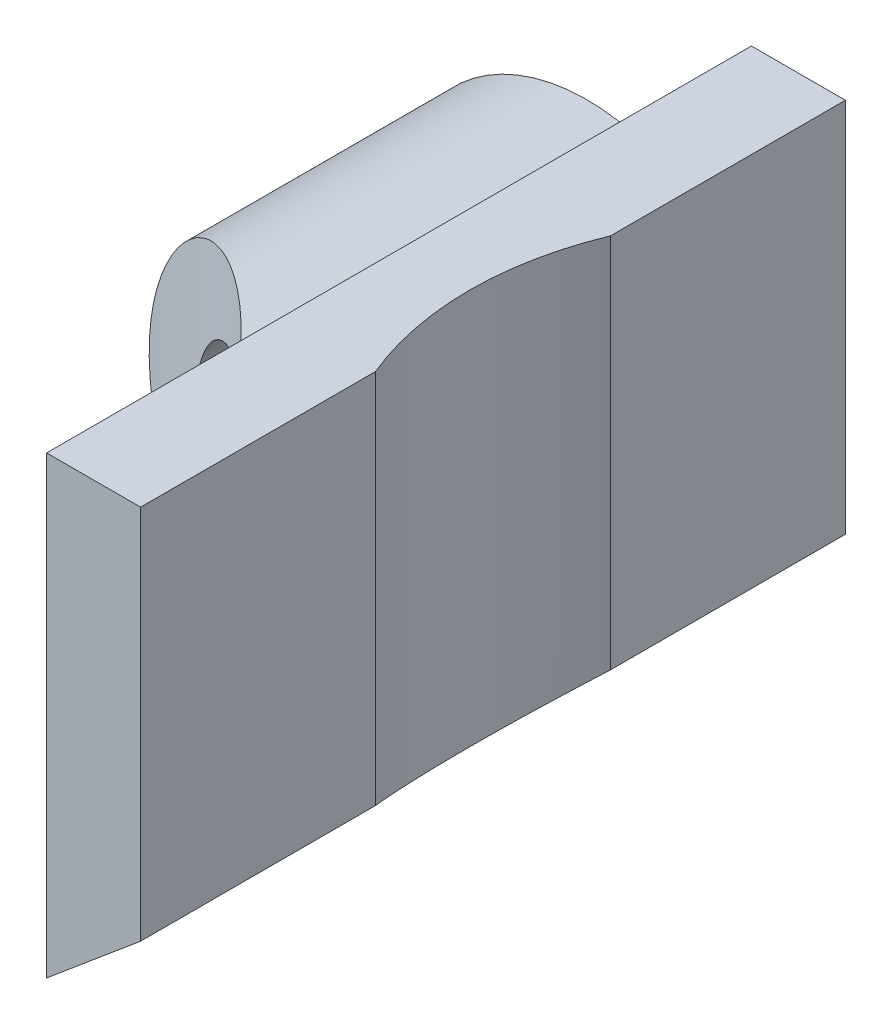
ISO-10303-21;
HEADER;
FILE_DESCRIPTION(('STEP AP214'),'2;1');
FILE_NAME('part.step','',(''),(''),'','','');
FILE_SCHEMA(('AUTOMOTIVE_DESIGN { 1 0 10303 214 1 1 1 1 }'));
ENDSEC;
DATA;
#1=APPLICATION_CONTEXT('core data for automotive mechanical design processes');
#2=APPLICATION_PROTOCOL_DEFINITION('international standard','automotive_design',2000,#1);
#3=PRODUCT_CONTEXT('',#1,'mechanical');
#4=PRODUCT('Part','Part','',(#3));
#5=PRODUCT_RELATED_PRODUCT_CATEGORY('part','',(#4));
#6=PRODUCT_DEFINITION_FORMATION('','',#4);
#7=PRODUCT_DEFINITION_CONTEXT('part definition',#1,'design');
#8=PRODUCT_DEFINITION('design','',#6,#7);
#9=PRODUCT_DEFINITION_SHAPE('','',#8);
#10=(LENGTH_UNIT() NAMED_UNIT(*) SI_UNIT(.MILLI.,.METRE.));
#11=(NAMED_UNIT(*) PLANE_ANGLE_UNIT() SI_UNIT($,.RADIAN.));
#12=(NAMED_UNIT(*) SI_UNIT($,.STERADIAN.) SOLID_ANGLE_UNIT());
#13=UNCERTAINTY_MEASURE_WITH_UNIT(LENGTH_MEASURE(1.E-05),#10,'distance_accuracy_value','');
#14=(GEOMETRIC_REPRESENTATION_CONTEXT(3) GLOBAL_UNCERTAINTY_ASSIGNED_CONTEXT((#13)) GLOBAL_UNIT_ASSIGNED_CONTEXT((#10,
#11,#12)) REPRESENTATION_CONTEXT('',''));
#15=CARTESIAN_POINT('',(0.,0.,0.));
#16=DIRECTION('',(0.,0.,1.));
#17=DIRECTION('',(1.,0.,0.));
#18=AXIS2_PLACEMENT_3D('',#15,#16,#17);
#19=CARTESIAN_POINT('',(1.5,5.80947501931113,15.));
#20=DIRECTION('',(0.,0.,-1.));
#21=DIRECTION('',(-1.,0.,0.));
#22=AXIS2_PLACEMENT_3D('',#19,#20,#21);
#23=PLANE('',#22);
#24=DIRECTION('',(0.,1.,0.));
#25=VECTOR('',#24,1.);
#26=CARTESIAN_POINT('',(3.5,-4.,15.));
#27=LINE('',#26,#25);
#28=CARTESIAN_POINT('',(3.5,-2.93748409287477,15.));
#29=VERTEX_POINT('',#28);
#30=CARTESIAN_POINT('',(3.5,5.80947501931113,15.));
#31=VERTEX_POINT('',#30);
#32=EDGE_CURVE('E199',#29,#31,#27,.T.);
#33=ORIENTED_EDGE('',*,*,#32,.F.);
#34=DIRECTION('',(0.766044443118974,0.642787609686544,0.));
#35=VECTOR('',#34,1.);
#36=CARTESIAN_POINT('',(3.5,-2.93748409287477,15.));
#37=LINE('',#36,#35);
#38=CARTESIAN_POINT('',(5.5,-1.25928483052019,15.));
#39=VERTEX_POINT('',#38);
#40=EDGE_CURVE('E172',#29,#39,#37,.T.);
#41=ORIENTED_EDGE('',*,*,#40,.T.);
#42=DIRECTION('',(0.,1.,0.));
#43=VECTOR('',#42,1.);
#44=CARTESIAN_POINT('',(5.5,6.74071516947981,15.));
#45=LINE('',#44,#43);
#46=CARTESIAN_POINT('',(5.5,6.74071516947981,15.));
#47=VERTEX_POINT('',#46);
#48=EDGE_CURVE('E185',#39,#47,#45,.T.);
#49=ORIENTED_EDGE('',*,*,#48,.T.);
#50=DIRECTION('',(-1.,0.,0.));
#51=VECTOR('',#50,1.);
#52=CARTESIAN_POINT('',(3.5,6.74071516947981,15.));
#53=LINE('',#52,#51);
#54=CARTESIAN_POINT('',(3.5,6.74071516947981,15.));
#55=VERTEX_POINT('',#54);
#56=EDGE_CURVE('E128',#47,#55,#53,.T.);
#57=ORIENTED_EDGE('',*,*,#56,.T.);
#58=DIRECTION('',(0.,-1.,0.));
#59=VECTOR('',#58,1.);
#60=CARTESIAN_POINT('',(3.5,6.74071516947981,15.));
#61=LINE('',#60,#59);
#62=EDGE_CURVE('E175',#55,#31,#61,.T.);
#63=ORIENTED_EDGE('',*,*,#62,.T.);
#64=EDGE_LOOP('',(#33,#41,#49,#57,#63));
#65=FACE_BOUND('',#64,.T.);
#66=ADVANCED_FACE('F34',(#65),#23,.F.);
#67=CARTESIAN_POINT('',(1.5,5.80947501931113,15.));
#68=DIRECTION('',(0.,0.,-1.));
#69=DIRECTION('',(-1.,0.,0.));
#70=AXIS2_PLACEMENT_3D('',#67,#68,#69);
#71=CYLINDRICAL_SURFACE('',#70,2.);
#72=CARTESIAN_POINT('',(1.,3.87298334620742,8.38562172233853));
#73=CARTESIAN_POINT('',(1.08122962166787,3.85205662075169,8.47769230588687));
#74=CARTESIAN_POINT('',(1.16127806092368,3.83678652200642,8.57191089146819));
#75=CARTESIAN_POINT('',(1.31818429199702,3.81617808733942,8.76371996314634));
#76=CARTESIAN_POINT('',(1.39504827808418,3.81081949048237,8.86130315422257));
#77=CARTESIAN_POINT('',(1.54433829670306,3.80858972855139,9.05830130906102));
#78=CARTESIAN_POINT('',(1.61680128070711,3.81163347694236,9.15768785824596));
#79=CARTESIAN_POINT('',(1.75783650453744,3.82489938905241,9.3587918884667));
#80=CARTESIAN_POINT('',(1.8264059985852,3.83512655235975,9.46051094517973));
#81=CARTESIAN_POINT('',(1.99964112017671,3.86983083982674,9.72793980549392));
#82=CARTESIAN_POINT('',(2.10105082024959,3.89918563030702,9.89513741229727));
#83=CARTESIAN_POINT('',(2.29285714125529,3.97049506641297,10.2330863614972));
#84=CARTESIAN_POINT('',(2.38324982754264,4.01245419515703,10.403838948186));
#85=CARTESIAN_POINT('',(2.55363553327463,4.10671362954848,10.7492324686974));
#86=CARTESIAN_POINT('',(2.63354990223381,4.15908545600317,10.9238924341501));
#87=CARTESIAN_POINT('',(2.78237660366021,4.27187162178355,11.2752325553733));
#88=CARTESIAN_POINT('',(2.85128920956719,4.33228576115573,11.4519126608178));
#89=CARTESIAN_POINT('',(3.01338337166559,4.49451158608416,11.9046753480346));
#90=CARTESIAN_POINT('',(3.09901178482468,4.60078987030453,12.1818821694359));
#91=CARTESIAN_POINT('',(3.2452605414245,4.82365735258303,12.7388336055686));
#92=CARTESIAN_POINT('',(3.3058642680456,4.94025333958666,13.0185797809042));
#93=CARTESIAN_POINT('',(3.40253938012748,5.1794493733236,13.5786527613363));
#94=CARTESIAN_POINT('',(3.43868519374808,5.30202997626413,13.8589751772305));
#95=CARTESIAN_POINT('',(3.48714192777488,5.55018579871752,14.4201489973548));
#96=CARTESIAN_POINT('',(3.49947090896353,5.67575867591433,14.7009998389587));
#97=CARTESIAN_POINT('',(3.49999444149778,5.80403173173893,14.9878284366554));
#98=CARTESIAN_POINT('',(3.49999999681102,5.80675338853771,14.9939142461653));
#99=CARTESIAN_POINT('',(3.5,5.80947501931113,15.));
#100=B_SPLINE_CURVE_WITH_KNOTS('',3,(#72,#73,#74,#75,#76,#77,#78,#79,#80,#81,#82,#83,#84,#85,
#86,#87,#88,#89,#90,#91,#92,#93,#94,#95,#96,#97,#98,#99),.UNSPECIFIED.,.F.,.F.,(4,2,2,2,2,2,2,2,
2,2,2,2,2,4),(0.,0.373311717457123,0.745859470022611,1.11464848710846,1.48369443249626,
2.07598119861721,2.66847887957921,3.265196282409,3.86189885200982,4.78742377980377,
5.71356228751308,6.63686962239288,7.55947651949963,7.57947652644407),.UNSPECIFIED.);
#101=CARTESIAN_POINT('',(0.999999999999997,3.87298334620742,8.38562172233852));
#102=VERTEX_POINT('',#101);
#103=EDGE_CURVE('E194',#31,#102,#100,.F.);
#104=ORIENTED_EDGE('',*,*,#103,.F.);
#105=DIRECTION('',(0.,0.,-1.));
#106=VECTOR('',#105,1.);
#107=CARTESIAN_POINT('',(3.5,5.80947501931113,15.));
#108=LINE('',#107,#106);
#109=CARTESIAN_POINT('',(3.5,5.80947501931113,0.));
#110=VERTEX_POINT('',#109);
#111=EDGE_CURVE('E173',#31,#110,#108,.T.);
#112=ORIENTED_EDGE('',*,*,#111,.T.);
#113=CARTESIAN_POINT('',(1.5,5.80947501931113,0.));
#114=DIRECTION('',(0.,0.,-1.));
#115=DIRECTION('',(-1.,0.,0.));
#116=AXIS2_PLACEMENT_3D('',#113,#114,#115);
#117=CIRCLE('',#116,2.);
#118=CARTESIAN_POINT('',(1.,3.87298334620742,0.));
#119=VERTEX_POINT('',#118);
#120=EDGE_CURVE('E163',#110,#119,#117,.T.);
#121=ORIENTED_EDGE('',*,*,#120,.T.);
#122=DIRECTION('',(0.,0.,-1.));
#123=VECTOR('',#122,1.);
#124=CARTESIAN_POINT('',(1.,3.87298334620742,15.));
#125=LINE('',#124,#123);
#126=EDGE_CURVE('E12',#102,#119,#125,.T.);
#127=ORIENTED_EDGE('',*,*,#126,.F.);
#128=EDGE_LOOP('',(#104,#112,#121,#127));
#129=FACE_BOUND('',#128,.T.);
#130=ADVANCED_FACE('F36',(#129),#71,.F.);
#131=CARTESIAN_POINT('',(0.,0.,15.));
#132=DIRECTION('',(0.,0.,-1.));
#133=DIRECTION('',(-1.,0.,0.));
#134=AXIS2_PLACEMENT_3D('',#131,#132,#133);
#135=CYLINDRICAL_SURFACE('',#134,4.);
#136=CARTESIAN_POINT('',(0.,0.,0.));
#137=DIRECTION('',(0.,0.,1.));
#138=DIRECTION('',(1.,0.,0.));
#139=AXIS2_PLACEMENT_3D('',#136,#137,#138);
#140=CIRCLE('',#139,4.);
#141=CARTESIAN_POINT('',(2.7149930394216,-2.93748409287477,0.));
#142=VERTEX_POINT('',#141);
#143=EDGE_CURVE('E155',#119,#142,#140,.T.);
#144=ORIENTED_EDGE('',*,*,#143,.T.);
#145=DIRECTION('',(0.,0.,-1.));
#146=VECTOR('',#145,1.);
#147=CARTESIAN_POINT('',(2.7149930394216,-2.93748409287477,15.));
#148=LINE('',#147,#146);
#149=CARTESIAN_POINT('',(2.7149930394216,-2.93748409287477,11.1161998914193));
#150=VERTEX_POINT('',#149);
#151=EDGE_CURVE('E48',#150,#142,#148,.T.);
#152=ORIENTED_EDGE('',*,*,#151,.F.);
#153=CARTESIAN_POINT('',(0.999999999999997,3.87298334620742,8.38562172233852));
#154=CARTESIAN_POINT('',(0.890103672967613,3.90135018926768,8.26098123270397));
#155=CARTESIAN_POINT('',(0.776553606956286,3.92568454092256,8.13851852069465));
#156=CARTESIAN_POINT('',(0.542421224341538,3.96483543905595,7.89842452631231));
#157=CARTESIAN_POINT('',(0.421824752193663,3.97963205429242,7.78080383919811));
#158=CARTESIAN_POINT('',(0.173344267305653,3.99819814437988,7.55047496702658));
#159=CARTESIAN_POINT('',(0.0454095557438663,4.00187820972438,7.43781375778781));
#160=CARTESIAN_POINT('',(-0.215822153413342,3.996306558784,7.219380528564));
#161=CARTESIAN_POINT('',(-0.349114269327247,3.98706636715839,7.11360245697555));
#162=CARTESIAN_POINT('',(-0.583918231227427,3.958419836024,6.93678031918107));
#163=CARTESIAN_POINT('',(-0.684502614847721,3.94235207172191,6.8639538602129));
#164=CARTESIAN_POINT('',(-0.887142042336052,3.90174972992817,6.72285954595999));
#165=CARTESIAN_POINT('',(-0.989196759028148,3.87721700899006,6.65459069500542));
#166=CARTESIAN_POINT('',(-1.19359590523437,3.81923777906677,6.52316136969763));
#167=CARTESIAN_POINT('',(-1.29593841072289,3.78581958019557,6.45998548741471));
#168=CARTESIAN_POINT('',(-1.50021346387561,3.70961467638868,6.33880864108122));
#169=CARTESIAN_POINT('',(-1.60214601675133,3.66682809093424,6.28080761104559));
#170=CARTESIAN_POINT('',(-1.80527068211393,3.57123188589201,6.16976657262179));
#171=CARTESIAN_POINT('',(-1.90645007130664,3.5183437390977,6.11677064748985));
#172=CARTESIAN_POINT('',(-2.10592667995866,3.40269901526784,6.01642694296727));
#173=CARTESIAN_POINT('',(-2.20422418602913,3.33994342355376,5.96907860046214));
#174=CARTESIAN_POINT('',(-2.39666562227071,3.20465839596477,5.88002753738153));
#175=CARTESIAN_POINT('',(-2.49080709701681,3.13212328217766,5.83832812493796));
#176=CARTESIAN_POINT('',(-2.67353454677338,2.97767011754605,5.76051815779106));
#177=CARTESIAN_POINT('',(-2.76212112187104,2.89575308292762,5.72440699877656));
#178=CARTESIAN_POINT('',(-2.92310999838718,2.73259686741584,5.66123683037599));
#179=CARTESIAN_POINT('',(-2.9962212965685,2.65227102895325,5.63361924115178));
#180=CARTESIAN_POINT('',(-3.13624180715008,2.48513067633013,5.58242651642555));
#181=CARTESIAN_POINT('',(-3.20314901360059,2.39831407980788,5.55885268630027));
#182=CARTESIAN_POINT('',(-3.32994855549834,2.21889678354056,5.51552518378444));
#183=CARTESIAN_POINT('',(-3.38984558278409,2.1263000167855,5.49576895048434));
#184=CARTESIAN_POINT('',(-3.50205894157072,1.9359225310921,5.45977858520852));
#185=CARTESIAN_POINT('',(-3.55437246334472,1.83813990900229,5.44354575757014));
#186=CARTESIAN_POINT('',(-3.64898428304801,1.64204254369433,5.41490439096056));
#187=CARTESIAN_POINT('',(-3.6915917996318,1.5438948130138,5.40237217283006));
#188=CARTESIAN_POINT('',(-3.7689028217982,1.34418759662326,5.38008687720605));
#189=CARTESIAN_POINT('',(-3.80360351257386,1.24262691062937,5.37033478912143));
#190=CARTESIAN_POINT('',(-3.86476194384391,1.03688427122474,5.3534188657062));
#191=CARTESIAN_POINT('',(-3.89122266461097,0.932703280307662,5.34625409443217));
#192=CARTESIAN_POINT('',(-3.93569919470027,0.72237805001168,5.33434471008081));
#193=CARTESIAN_POINT('',(-3.95371186206315,0.616233095436341,5.32960099737418));
#194=CARTESIAN_POINT('',(-3.9812094258929,0.402110942919025,5.32240226767575));
#195=CARTESIAN_POINT('',(-3.99064185368741,0.294126531587454,5.31996132896189));
#196=CARTESIAN_POINT('',(-4.00071340562613,0.0776813775361063,5.31735606084904));
#197=CARTESIAN_POINT('',(-4.00134927440825,-0.0307795266679229,5.31719257427166));
#198=CARTESIAN_POINT('',(-3.99381483898963,-0.247340594026591,5.31913995849331));
#199=CARTESIAN_POINT('',(-3.98564733958953,-0.355440861078017,5.32125010490052));
#200=CARTESIAN_POINT('',(-3.96057598155613,-0.570590960062872,5.32779794743723));
#201=CARTESIAN_POINT('',(-3.94366889904967,-0.677640389502458,5.33223650248327));
#202=CARTESIAN_POINT('',(-3.90116515365941,-0.890345206037334,5.34357492253879));
#203=CARTESIAN_POINT('',(-3.87553230943144,-0.995992854270178,5.35048504203147));
#204=CARTESIAN_POINT('',(-3.81582924662536,-1.20467918667702,5.36692286394226));
#205=CARTESIAN_POINT('',(-3.78175590090253,-1.30771688825399,5.3764515366588));
#206=CARTESIAN_POINT('',(-3.66731421705799,-1.61168668883981,5.40926133611857));
#207=CARTESIAN_POINT('',(-3.57467332658862,-1.80772786083482,5.43677859556524));
#208=CARTESIAN_POINT('',(-3.3609300331053,-2.17942737583313,5.50480869888392));
#209=CARTESIAN_POINT('',(-3.23999929149662,-2.35519946730149,5.54524367943349));
#210=CARTESIAN_POINT('',(-2.97424537077405,-2.68297116218954,5.64110371083308));
#211=CARTESIAN_POINT('',(-2.82942637984384,-2.83497492368433,5.6965261351115));
#212=CARTESIAN_POINT('',(-2.52274869718014,-3.11096677637685,5.8234637139028));
#213=CARTESIAN_POINT('',(-2.36097392679224,-3.23508410152778,5.89490143443767));
#214=CARTESIAN_POINT('',(-2.02653172820206,-3.45444459126974,6.0544769377108));
#215=CARTESIAN_POINT('',(-1.85386330133194,-3.54968510394031,6.14261625304357));
#216=CARTESIAN_POINT('',(-1.49717023143913,-3.71465497183713,6.33889324251466));
#217=CARTESIAN_POINT('',(-1.31296832870512,-3.78320197972507,6.44769353667199));
#218=CARTESIAN_POINT('',(-0.946152500582999,-3.89119526967298,6.68122129785614));
#219=CARTESIAN_POINT('',(-0.763539409684936,-3.93062707559799,6.80595665172121));
#220=CARTESIAN_POINT('',(-0.455974478532091,-3.97604298092859,7.03161528823934));
#221=CARTESIAN_POINT('',(-0.329419584105405,-3.98835627364429,7.12919577167258));
#222=CARTESIAN_POINT('',(-0.0807453424268346,-4.00112210311474,7.33066095970992));
#223=CARTESIAN_POINT('',(0.0413724348014406,-4.00157048164188,7.43454786170355));
#224=CARTESIAN_POINT('',(0.280419149752325,-3.9919550384319,7.64801706710102));
#225=CARTESIAN_POINT('',(0.397338892137689,-3.98187330453268,7.75760877284116));
#226=CARTESIAN_POINT('',(0.625212912511718,-3.95250681048937,7.98167452375474));
#227=CARTESIAN_POINT('',(0.736165388593415,-3.93321928768597,8.09615002515918));
#228=CARTESIAN_POINT('',(0.998768666179977,-3.876538949098,8.38029615769756));
#229=CARTESIAN_POINT('',(1.14704694285338,-3.83491812858921,8.55225032387079));
#230=CARTESIAN_POINT('',(1.42998627881607,-3.73864772845122,8.90358624960444));
#231=CARTESIAN_POINT('',(1.56464007000521,-3.68399124648206,9.08297190239151));
#232=CARTESIAN_POINT('',(1.82026069545521,-3.56462564295041,9.44815601141847));
#233=CARTESIAN_POINT('',(1.94121925240458,-3.49991049746473,9.63395825821787));
#234=CARTESIAN_POINT('',(2.1694396563962,-3.36321439908002,10.0110742523162));
#235=CARTESIAN_POINT('',(2.27670694674309,-3.29123635423563,10.2023857719561));
#236=CARTESIAN_POINT('',(2.43859920910302,-3.17160082525894,10.5145560575591));
#237=CARTESIAN_POINT('',(2.49744617556622,-3.12539916040341,10.633810297985));
#238=CARTESIAN_POINT('',(2.60999329307876,-3.03204041230585,10.87380274311));
#239=CARTESIAN_POINT('',(2.6637102320454,-2.98488710329286,10.9945345387253));
#240=CARTESIAN_POINT('',(2.7149930394216,-2.93748409287477,11.1161998914193));
#241=B_SPLINE_CURVE_WITH_KNOTS('',3,(#153,#154,#155,#156,#157,#158,#159,#160,#161,#162,#163,
#164,#165,#166,#167,#168,#169,#170,#171,#172,#173,#174,#175,#176,#177,#178,#179,#180,#181,#182,
#183,#184,#185,#186,#187,#188,#189,#190,#191,#192,#193,#194,#195,#196,#197,#198,#199,#200,#201,
#202,#203,#204,#205,#206,#207,#208,#209,#210,#211,#212,#213,#214,#215,#216,#217,#218,#219,#220,
#221,#222,#223,#224,#225,#226,#227,#228,#229,#230,#231,#232,#233,#234,#235,#236,#237,#238,#239,
#240),.UNSPECIFIED.,.F.,.F.,(4,2,2,2,2,2,2,2,2,2,2,2,2,2,2,2,2,2,2,2,2,2,2,2,2,2,2,2,2,2,2,2,2,
2,2,2,2,2,2,2,2,2,2,4),(0.,0.505761235667478,1.01257597565941,1.52345627494703,2.03388116789633,
2.40919076935856,2.78441810933121,3.15846396913633,3.53250505876389,3.90958180936337,
4.28662093055226,4.66387990795253,5.04109806018797,5.37689383038387,5.71279779654667,
6.048475644307,6.38427754625241,6.7070851004616,7.03000739429698,7.35281275599673,
7.6757380788959,8.0006250880469,8.3256323256389,8.65053604477016,8.97555970058868,
9.30194782254814,9.62845705027945,10.2807120872432,10.9291074840992,11.577389322266,
12.2226018456523,12.8678736046069,13.5391414259626,14.210742778652,14.690971689012,
15.1713689001829,15.6525846200585,16.1339448437668,16.8253958245186,17.5172137423139,
18.2094475832155,18.9014053462896,19.32365236187,19.7444664936259),.UNSPECIFIED.);
#242=EDGE_CURVE('E55',#102,#150,#241,.T.);
#243=ORIENTED_EDGE('',*,*,#242,.F.);
#244=ORIENTED_EDGE('',*,*,#126,.T.);
#245=EDGE_LOOP('',(#144,#152,#243,#244));
#246=FACE_BOUND('',#245,.T.);
#247=ADVANCED_FACE('F215',(#246),#135,.T.);
#248=CARTESIAN_POINT('',(3.5,-2.93748409287477,15.));
#249=DIRECTION('',(0.,1.,0.));
#250=DIRECTION('',(0.,0.,1.));
#251=AXIS2_PLACEMENT_3D('',#248,#249,#250);
#252=PLANE('',#251);
#253=CARTESIAN_POINT('',(-6.5,-2.93748409287477,15.));
#254=DIRECTION('',(0.,1.,0.));
#255=DIRECTION('',(0.,0.,1.));
#256=AXIS2_PLACEMENT_3D('',#253,#254,#255);
#257=CIRCLE('',#256,10.);
#258=EDGE_CURVE('E147',#150,#29,#257,.F.);
#259=ORIENTED_EDGE('',*,*,#258,.F.);
#260=ORIENTED_EDGE('',*,*,#151,.T.);
#261=DIRECTION('',(1.,0.,0.));
#262=VECTOR('',#261,1.);
#263=CARTESIAN_POINT('',(3.5,-2.93748409287477,0.));
#264=LINE('',#263,#262);
#265=CARTESIAN_POINT('',(3.5,-2.93748409287477,0.));
#266=VERTEX_POINT('',#265);
#267=EDGE_CURVE('E146',#142,#266,#264,.T.);
#268=ORIENTED_EDGE('',*,*,#267,.T.);
#269=DIRECTION('',(0.,0.,-1.));
#270=VECTOR('',#269,1.);
#271=CARTESIAN_POINT('',(3.5,-2.93748409287477,15.));
#272=LINE('',#271,#270);
#273=EDGE_CURVE('E137',#29,#266,#272,.T.);
#274=ORIENTED_EDGE('',*,*,#273,.F.);
#275=EDGE_LOOP('',(#259,#260,#268,#274));
#276=FACE_BOUND('',#275,.T.);
#277=ADVANCED_FACE('F144',(#276),#252,.F.);
#278=CARTESIAN_POINT('',(5.5,6.74071516947981,15.));
#279=DIRECTION('',(-1.,0.,0.));
#280=DIRECTION('',(0.,-1.,0.));
#281=AXIS2_PLACEMENT_3D('',#278,#279,#280);
#282=PLANE('',#281);
#283=DIRECTION('',(0.,1.,0.));
#284=VECTOR('',#283,1.);
#285=CARTESIAN_POINT('',(5.5,-4.,10.));
#286=LINE('',#285,#284);
#287=CARTESIAN_POINT('',(5.5,-1.25928483052019,10.));
#288=VERTEX_POINT('',#287);
#289=CARTESIAN_POINT('',(5.5,6.74071516947981,10.));
#290=VERTEX_POINT('',#289);
#291=EDGE_CURVE('E110',#288,#290,#286,.T.);
#292=ORIENTED_EDGE('',*,*,#291,.T.);
#293=DIRECTION('',(0.,0.,-1.));
#294=VECTOR('',#293,1.);
#295=CARTESIAN_POINT('',(5.5,6.74071516947981,15.));
#296=LINE('',#295,#294);
#297=EDGE_CURVE('E121',#47,#290,#296,.T.);
#298=ORIENTED_EDGE('',*,*,#297,.F.);
#299=ORIENTED_EDGE('',*,*,#48,.F.);
#300=DIRECTION('',(0.,0.,-1.));
#301=VECTOR('',#300,1.);
#302=CARTESIAN_POINT('',(5.5,-1.25928483052019,15.));
#303=LINE('',#302,#301);
#304=EDGE_CURVE('E124',#39,#288,#303,.T.);
#305=ORIENTED_EDGE('',*,*,#304,.T.);
#306=EDGE_LOOP('',(#292,#298,#299,#305));
#307=FACE_BOUND('',#306,.T.);
#308=ADVANCED_FACE('F119',(#307),#282,.F.);
#309=DIRECTION('',(0.,1.,0.));
#310=VECTOR('',#309,1.);
#311=CARTESIAN_POINT('',(5.5,-4.,4.99999999999999));
#312=LINE('',#311,#310);
#313=CARTESIAN_POINT('',(5.5,-1.25928483052019,4.99999999999999));
#314=VERTEX_POINT('',#313);
#315=CARTESIAN_POINT('',(5.5,6.74071516947981,4.99999999999998));
#316=VERTEX_POINT('',#315);
#317=EDGE_CURVE('E63',#314,#316,#312,.T.);
#318=ORIENTED_EDGE('',*,*,#317,.F.);
#319=CARTESIAN_POINT('',(5.5,-1.25928483052019,0.));
#320=VERTEX_POINT('',#319);
#321=EDGE_CURVE('E129',#314,#320,#303,.T.);
#322=ORIENTED_EDGE('',*,*,#321,.T.);
#323=DIRECTION('',(0.,1.,0.));
#324=VECTOR('',#323,1.);
#325=CARTESIAN_POINT('',(5.5,6.74071516947981,0.));
#326=LINE('',#325,#324);
#327=CARTESIAN_POINT('',(5.5,6.74071516947981,0.));
#328=VERTEX_POINT('',#327);
#329=EDGE_CURVE('E161',#320,#328,#326,.T.);
#330=ORIENTED_EDGE('',*,*,#329,.T.);
#331=EDGE_CURVE('E130',#316,#328,#296,.T.);
#332=ORIENTED_EDGE('',*,*,#331,.F.);
#333=EDGE_LOOP('',(#318,#322,#330,#332));
#334=FACE_BOUND('',#333,.T.);
#335=ADVANCED_FACE('F204',(#334),#282,.F.);
#336=CARTESIAN_POINT('',(0.,0.,15.));
#337=DIRECTION('',(0.,0.,-1.));
#338=DIRECTION('',(-1.,0.,0.));
#339=AXIS2_PLACEMENT_3D('',#336,#337,#338);
#340=CYLINDRICAL_SURFACE('',#339,2.5);
#341=CARTESIAN_POINT('',(0.,0.,0.));
#342=DIRECTION('',(0.,0.,1.));
#343=DIRECTION('',(1.,0.,0.));
#344=AXIS2_PLACEMENT_3D('',#341,#342,#343);
#345=CIRCLE('',#344,2.5);
#346=CARTESIAN_POINT('',(2.5,0.,0.));
#347=VERTEX_POINT('',#346);
#348=EDGE_CURVE('E188',#347,#347,#345,.T.);
#349=ORIENTED_EDGE('',*,*,#348,.F.);
#350=EDGE_LOOP('',(#349));
#351=FACE_BOUND('',#350,.T.);
#352=CARTESIAN_POINT('',(-2.5,0.,5.83484861008832));
#353=CARTESIAN_POINT('',(-2.49999285367165,-0.130144477127561,5.83484906948271));
#354=CARTESIAN_POINT('',(-2.48978763751346,-0.260413385808494,5.83928467613748));
#355=CARTESIAN_POINT('',(-2.44935657998211,-0.517310544980222,5.8570926226095));
#356=CARTESIAN_POINT('',(-2.41910012954218,-0.643932920034684,5.87047862586992));
#357=CARTESIAN_POINT('',(-2.33990573492709,-0.889645654055668,5.90629400633492));
#358=CARTESIAN_POINT('',(-2.2909940724404,-1.00874633578352,5.92871066353209));
#359=CARTESIAN_POINT('',(-2.17660445014906,-1.23637358039301,5.98267067576403));
#360=CARTESIAN_POINT('',(-2.11113198629867,-1.34490363478074,6.01421100346746));
#361=CARTESIAN_POINT('',(-1.96511496878814,-1.55064732155292,6.08700041496356));
#362=CARTESIAN_POINT('',(-1.88433117346792,-1.64763494181206,6.12840673543874));
#363=CARTESIAN_POINT('',(-1.71177971786212,-1.82626581479678,6.22033637829388));
#364=CARTESIAN_POINT('',(-1.62000935181586,-1.90790527481706,6.27086194811429));
#365=CARTESIAN_POINT('',(-1.42250440148688,-2.05986179817122,6.38415264789852));
#366=CARTESIAN_POINT('',(-1.31624595641476,-2.12905088345777,6.4475117298504));
#367=CARTESIAN_POINT('',(-1.09903516718349,-2.24889579491473,6.58299427869038));
#368=CARTESIAN_POINT('',(-0.988081121504793,-2.29954483755546,6.6551209406755));
#369=CARTESIAN_POINT('',(-0.7501833973667,-2.38859763723828,6.81691429824577));
#370=CARTESIAN_POINT('',(-0.623045336561047,-2.42453554493727,6.90764136402143));
#371=CARTESIAN_POINT('',(-0.370593785231085,-2.47573805319363,7.09713126912945));
#372=CARTESIAN_POINT('',(-0.245281780078339,-2.49098666196391,7.19590026203537));
#373=CARTESIAN_POINT('',(-0.0290111350701591,-2.50157334019364,7.37497614212597));
#374=CARTESIAN_POINT('',(0.0629044809555385,-2.50084517171584,7.4539467475077));
#375=CARTESIAN_POINT('',(0.243514352583784,-2.48975674587956,7.61490400599275));
#376=CARTESIAN_POINT('',(0.332207242401361,-2.47939245310109,7.69689190886483));
#377=CARTESIAN_POINT('',(0.505939162812242,-2.44985806117783,7.86338149629062));
#378=CARTESIAN_POINT('',(0.590971812214627,-2.43067321444217,7.94788716827887));
#379=CARTESIAN_POINT('',(0.756866211904881,-2.38423412224345,8.11871611614282));
#380=CARTESIAN_POINT('',(0.837728443163165,-2.35698080976357,8.20503918079601));
#381=CARTESIAN_POINT('',(0.996561130575618,-2.29440440484829,8.38064540974432));
#382=CARTESIAN_POINT('',(1.07444679731129,-2.25893705472776,8.46995361719265));
#383=CARTESIAN_POINT('',(1.22549054457796,-2.18068998196149,8.64936638000363));
#384=CARTESIAN_POINT('',(1.29864822938738,-2.13790964832474,8.73947100130871));
#385=CARTESIAN_POINT('',(1.44006208782498,-2.04532663463417,8.91982409362873));
#386=CARTESIAN_POINT('',(1.50832081827258,-1.99552765850898,9.01007246410506));
#387=CARTESIAN_POINT('',(1.63983950531906,-1.88893968965688,9.19005812260413));
#388=CARTESIAN_POINT('',(1.70310070424304,-1.83215244316332,9.27979553246579));
#389=CARTESIAN_POINT('',(1.8066813521445,-1.72903573986398,9.43179949891902));
#390=CARTESIAN_POINT('',(1.84829452950205,-1.68451290650845,9.49441596000369));
#391=CARTESIAN_POINT('',(1.92883594055502,-1.59165641346842,9.61853241004684));
#392=CARTESIAN_POINT('',(1.96776463978505,-1.54332341766302,9.68003259121758));
#393=CARTESIAN_POINT('',(2.04276838106133,-1.44258094920574,9.80132841154932));
#394=CARTESIAN_POINT('',(2.07884568536824,-1.39017477499199,9.86112537742872));
#395=CARTESIAN_POINT('',(2.14793859548215,-1.28083526817014,9.97826916088861));
#396=CARTESIAN_POINT('',(2.18095547222813,-1.2239038332299,10.0356169901662));
#397=CARTESIAN_POINT('',(2.2503431276846,-1.09208591261793,10.158771788677));
#398=CARTESIAN_POINT('',(2.2859053678671,-1.01597280983722,10.2237414557013));
#399=CARTESIAN_POINT('',(2.3509053048433,-0.854852361431602,10.3453036951474));
#400=CARTESIAN_POINT('',(2.38035179507894,-0.769858053752326,10.4019082609265));
#401=CARTESIAN_POINT('',(2.42366485433421,-0.616576377263616,10.486711568125));
#402=CARTESIAN_POINT('',(2.43956232830921,-0.5508044747115,10.5183568558467));
#403=CARTESIAN_POINT('',(2.4663633490764,-0.414541754342309,10.5722197276243));
#404=CARTESIAN_POINT('',(2.47727671221279,-0.34406052843141,10.594455836913));
#405=CARTESIAN_POINT('',(2.49183905151265,-0.210933028000235,10.6242638281022));
#406=CARTESIAN_POINT('',(2.49635606861591,-0.148781142320009,10.6335829606395));
#407=CARTESIAN_POINT('',(2.50067071869209,-0.0236233102928267,10.6424829031859));
#408=CARTESIAN_POINT('',(2.50047094538353,0.039382147632587,10.642069065264));
#409=CARTESIAN_POINT('',(2.49538103477027,0.164242473405777,10.6315736461829));
#410=CARTESIAN_POINT('',(2.49049946767715,0.226099233122876,10.6215097298867));
#411=CARTESIAN_POINT('',(2.47651124005515,0.347315674978922,10.5929039911147));
#412=CARTESIAN_POINT('',(2.46740006000893,0.406672611769568,10.5743531002616));
#413=CARTESIAN_POINT('',(2.43984274353419,0.552455585109177,10.5188625062977));
#414=CARTESIAN_POINT('',(2.41900739040899,0.636679868403358,10.4773834343913));
#415=CARTESIAN_POINT('',(2.37100107789493,0.797132933998632,10.3839296404584));
#416=CARTESIAN_POINT('',(2.34381013846482,0.873335379053382,10.3319218899512));
#417=CARTESIAN_POINT('',(2.28692157045089,1.01249808972689,10.2257625091714));
#418=CARTESIAN_POINT('',(2.25761459014763,1.07603206299453,10.1721398530619));
#419=CARTESIAN_POINT('',(2.19543758997994,1.19780308930771,10.0610300764933));
#420=CARTESIAN_POINT('',(2.16256458463997,1.2560356278077,10.0035397335403));
#421=CARTESIAN_POINT('',(2.09360139099204,1.36790248048506,9.88583536728108));
#422=CARTESIAN_POINT('',(2.05750472571029,1.42152709235212,9.82561598597431));
#423=CARTESIAN_POINT('',(1.98239137498629,1.52452781166364,9.70337924437612));
#424=CARTESIAN_POINT('',(1.94337379315636,1.57390260482309,9.64136133574895));
#425=CARTESIAN_POINT('',(1.836284020913,1.69960361908051,9.47537562945991));
#426=CARTESIAN_POINT('',(1.76582911389376,1.77255675473644,9.37037482492509));
#427=CARTESIAN_POINT('',(1.61781107330731,1.9086086957519,9.15895238485367));
#428=CARTESIAN_POINT('',(1.54024369899706,1.97170156059277,9.05252993440291));
#429=CARTESIAN_POINT('',(1.37826943368714,2.08813600989463,8.83958256794575));
#430=CARTESIAN_POINT('',(1.29386437864384,2.14148019948796,8.73305768698343));
#431=CARTESIAN_POINT('',(1.11848541860633,2.2380823876743,8.52098320080452));
#432=CARTESIAN_POINT('',(1.02751403021856,2.28134422381941,8.41543323925245));
#433=CARTESIAN_POINT('',(0.776906426896552,2.38219041538715,8.13698059844876));
#434=CARTESIAN_POINT('',(0.611550884470983,2.43040581790436,7.96556393818291));
#435=CARTESIAN_POINT('',(0.352313933929452,2.47660131096606,7.71575167520505));
#436=CARTESIAN_POINT('',(0.26407209147612,2.48764601066138,7.63373123494586));
#437=CARTESIAN_POINT('',(0.0843082995937622,2.50020233331367,7.47262109414939));
#438=CARTESIAN_POINT('',(-0.00721269041051261,2.50171672214343,7.39353054992687));
#439=CARTESIAN_POINT('',(-0.241614651945172,2.49232541279501,7.19830451244511));
#440=CARTESIAN_POINT('',(-0.386259308777462,2.47448965588862,7.08449386899327));
#441=CARTESIAN_POINT('',(-0.677615799593996,2.4110164463606,6.86779842058747));
#442=CARTESIAN_POINT('',(-0.824325092783506,2.36541066708629,6.76490132485257));
#443=CARTESIAN_POINT('',(-1.0903374536951,2.25354197661002,6.58829503521356));
#444=CARTESIAN_POINT('',(-1.21020970539253,2.19185807193548,6.51256211005068));
#445=CARTESIAN_POINT('',(-1.44274198558626,2.0462838980534,6.37198898209699));
#446=CARTESIAN_POINT('',(-1.5554046178342,1.96240170259997,6.30714483293032));
#447=CARTESIAN_POINT('',(-1.76886003447746,1.77246978956015,6.18913709526575));
#448=CARTESIAN_POINT('',(-1.86958256758194,1.66629816513188,6.13604118481161));
#449=CARTESIAN_POINT('',(-2.05291829721151,1.43434482769314,6.04265107851024));
#450=CARTESIAN_POINT('',(-2.13553235039837,1.30856404281937,6.00235627703763));
#451=CARTESIAN_POINT('',(-2.27025544504895,1.05560147547835,5.93830875813126));
#452=CARTESIAN_POINT('',(-2.32466124528088,0.929963192029456,5.91326057476991));
#453=CARTESIAN_POINT('',(-2.41238480293599,0.670160239838099,5.87345878038097));
#454=CARTESIAN_POINT('',(-2.44574512460173,0.536013388617011,5.85868438450037));
#455=CARTESIAN_POINT('',(-2.47851391996759,0.333858303734968,5.84424983409579));
#456=CARTESIAN_POINT('',(-2.48655940248987,0.267401965835538,5.84072443676403));
#457=CARTESIAN_POINT('',(-2.49730423331565,0.133974739722424,5.8360237279569));
#458=CARTESIAN_POINT('',(-2.50000367923097,0.0670038609260179,5.83484837357273));
#459=CARTESIAN_POINT('',(-2.5,0.,5.83484861008832));
#460=B_SPLINE_CURVE_WITH_KNOTS('',3,(#352,#353,#354,#355,#356,#357,#358,#359,#360,#361,#362,
#363,#364,#365,#366,#367,#368,#369,#370,#371,#372,#373,#374,#375,#376,#377,#378,#379,#380,#381,
#382,#383,#384,#385,#386,#387,#388,#389,#390,#391,#392,#393,#394,#395,#396,#397,#398,#399,#400,
#401,#402,#403,#404,#405,#406,#407,#408,#409,#410,#411,#412,#413,#414,#415,#416,#417,#418,#419,
#420,#421,#422,#423,#424,#425,#426,#427,#428,#429,#430,#431,#432,#433,#434,#435,#436,#437,#438,
#439,#440,#441,#442,#443,#444,#445,#446,#447,#448,#449,#450,#451,#452,#453,#454,#455,#456,#457,
#458,#459),.UNSPECIFIED.,.T.,.F.,(4,2,2,2,2,2,2,2,2,2,2,2,2,2,2,2,2,2,2,2,2,2,2,2,2,2,2,2,2,2,2,
2,2,2,2,2,2,2,2,2,2,2,2,2,2,2,2,2,2,2,2,2,2,4),(0.,0.390179397881371,0.780955797560107,
1.17118368816152,1.56128224521337,1.95807136492491,2.35495840723782,2.77848852091915,
3.20217344352808,3.68123695719875,4.16067055231382,4.52375836134446,4.88699829295603,
5.2508477672784,5.61465518491388,5.98541480103469,6.35620540883006,6.72680106795651,
7.09730430973499,7.35932112839747,7.6212923939773,7.88305368374068,8.14470577724376,
8.46269557290039,8.78022493693925,9.00363481275833,9.22660275870421,9.41476550397406,
9.60282478273743,9.79054046718701,9.97845719698889,10.2653108007956,10.5530786111139,
10.8171558923521,11.0814559906725,11.3462996104201,11.6112248427415,12.0485694029295,
12.4861764427607,12.9236663695919,13.3609895057645,14.0867102696343,14.4492790649501,
14.8117426312291,15.3642954222884,15.9162191717193,16.3781763348126,16.8399657095516,
17.3043497909126,17.7687118988121,18.1841549485781,18.5987550527744,18.7996395163303,
19.0005203119573),.UNSPECIFIED.);
#461=CARTESIAN_POINT('',(-2.5,0.,5.83484861008832));
#462=VERTEX_POINT('',#461);
#463=EDGE_CURVE('E39',#462,#462,#460,.T.);
#464=ORIENTED_EDGE('',*,*,#463,.T.);
#465=EDGE_LOOP('',(#464));
#466=FACE_BOUND('',#465,.T.);
#467=ADVANCED_FACE('F227',(#351,#466),#340,.F.);
#468=CARTESIAN_POINT('',(1.5,5.80947501931113,0.));
#469=DIRECTION('',(0.,0.,-1.));
#470=DIRECTION('',(-1.,0.,0.));
#471=AXIS2_PLACEMENT_3D('',#468,#469,#470);
#472=PLANE('',#471);
#473=ORIENTED_EDGE('',*,*,#120,.F.);
#474=DIRECTION('',(0.,-1.,0.));
#475=VECTOR('',#474,1.);
#476=CARTESIAN_POINT('',(3.5,6.74071516947981,0.));
#477=LINE('',#476,#475);
#478=CARTESIAN_POINT('',(3.5,6.74071516947981,0.));
#479=VERTEX_POINT('',#478);
#480=EDGE_CURVE('E171',#479,#110,#477,.T.);
#481=ORIENTED_EDGE('',*,*,#480,.F.);
#482=DIRECTION('',(-1.,0.,0.));
#483=VECTOR('',#482,1.);
#484=CARTESIAN_POINT('',(3.5,6.74071516947981,0.));
#485=LINE('',#484,#483);
#486=EDGE_CURVE('E169',#328,#479,#485,.T.);
#487=ORIENTED_EDGE('',*,*,#486,.F.);
#488=ORIENTED_EDGE('',*,*,#329,.F.);
#489=DIRECTION('',(0.766044443118974,0.642787609686544,0.));
#490=VECTOR('',#489,1.);
#491=CARTESIAN_POINT('',(3.5,-2.93748409287477,0.));
#492=LINE('',#491,#490);
#493=EDGE_CURVE('E159',#266,#320,#492,.T.);
#494=ORIENTED_EDGE('',*,*,#493,.F.);
#495=ORIENTED_EDGE('',*,*,#267,.F.);
#496=ORIENTED_EDGE('',*,*,#143,.F.);
#497=EDGE_LOOP('',(#473,#481,#487,#488,#494,#495,#496));
#498=FACE_BOUND('',#497,.T.);
#499=ORIENTED_EDGE('',*,*,#348,.T.);
#500=EDGE_LOOP('',(#499));
#501=FACE_BOUND('',#500,.T.);
#502=ADVANCED_FACE('F153',(#498,#501),#472,.T.);
#503=CARTESIAN_POINT('',(3.5,-2.93748409287477,15.));
#504=DIRECTION('',(-0.642787609686544,0.766044443118974,0.));
#505=DIRECTION('',(-0.766044443118974,-0.642787609686544,0.));
#506=AXIS2_PLACEMENT_3D('',#503,#504,#505);
#507=PLANE('',#506);
#508=CARTESIAN_POINT('',(11.5,3.77531295654355,7.5));
#509=DIRECTION('',(-0.642787609686544,0.766044443118974,0.));
#510=DIRECTION('',(0.766044443118974,0.642787609686544,0.));
#511=AXIS2_PLACEMENT_3D('',#508,#509,#510);
#512=ELLIPSE('',#511,8.48514738065986,6.50000000000001);
#513=EDGE_CURVE('E191',#288,#314,#512,.F.);
#514=ORIENTED_EDGE('',*,*,#513,.F.);
#515=ORIENTED_EDGE('',*,*,#304,.F.);
#516=ORIENTED_EDGE('',*,*,#40,.F.);
#517=ORIENTED_EDGE('',*,*,#273,.T.);
#518=ORIENTED_EDGE('',*,*,#493,.T.);
#519=ORIENTED_EDGE('',*,*,#321,.F.);
#520=EDGE_LOOP('',(#514,#515,#516,#517,#518,#519));
#521=FACE_BOUND('',#520,.T.);
#522=ADVANCED_FACE('F201',(#521),#507,.F.);
#523=CARTESIAN_POINT('',(3.5,6.74071516947981,15.));
#524=DIRECTION('',(0.,-1.,0.));
#525=DIRECTION('',(0.,0.,-1.));
#526=AXIS2_PLACEMENT_3D('',#523,#524,#525);
#527=PLANE('',#526);
#528=CARTESIAN_POINT('',(11.5,6.74071516947981,7.5));
#529=DIRECTION('',(0.,-1.,0.));
#530=DIRECTION('',(0.,0.,1.));
#531=AXIS2_PLACEMENT_3D('',#528,#529,#530);
#532=CIRCLE('',#531,6.50000000000001);
#533=EDGE_CURVE('E107',#290,#316,#532,.T.);
#534=ORIENTED_EDGE('',*,*,#533,.T.);
#535=ORIENTED_EDGE('',*,*,#331,.T.);
#536=ORIENTED_EDGE('',*,*,#486,.T.);
#537=DIRECTION('',(0.,0.,-1.));
#538=VECTOR('',#537,1.);
#539=CARTESIAN_POINT('',(3.5,6.74071516947981,15.));
#540=LINE('',#539,#538);
#541=EDGE_CURVE('E133',#55,#479,#540,.T.);
#542=ORIENTED_EDGE('',*,*,#541,.F.);
#543=ORIENTED_EDGE('',*,*,#56,.F.);
#544=ORIENTED_EDGE('',*,*,#297,.T.);
#545=EDGE_LOOP('',(#534,#535,#536,#542,#543,#544));
#546=FACE_BOUND('',#545,.T.);
#547=ADVANCED_FACE('F126',(#546),#527,.F.);
#548=CARTESIAN_POINT('',(3.5,6.74071516947981,15.));
#549=DIRECTION('',(1.,0.,0.));
#550=DIRECTION('',(0.,0.,-1.));
#551=AXIS2_PLACEMENT_3D('',#548,#549,#550);
#552=PLANE('',#551);
#553=ORIENTED_EDGE('',*,*,#480,.T.);
#554=ORIENTED_EDGE('',*,*,#111,.F.);
#555=ORIENTED_EDGE('',*,*,#62,.F.);
#556=ORIENTED_EDGE('',*,*,#541,.T.);
#557=EDGE_LOOP('',(#553,#554,#555,#556));
#558=FACE_BOUND('',#557,.T.);
#559=ADVANCED_FACE('F222',(#558),#552,.F.);
#560=CARTESIAN_POINT('',(-6.5,-4.,15.));
#561=DIRECTION('',(0.,1.,0.));
#562=DIRECTION('',(0.,0.,1.));
#563=AXIS2_PLACEMENT_3D('',#560,#561,#562);
#564=CYLINDRICAL_SURFACE('',#563,10.);
#565=ORIENTED_EDGE('',*,*,#463,.F.);
#566=EDGE_LOOP('',(#565));
#567=FACE_BOUND('',#566,.T.);
#568=ORIENTED_EDGE('',*,*,#103,.T.);
#569=ORIENTED_EDGE('',*,*,#242,.T.);
#570=ORIENTED_EDGE('',*,*,#258,.T.);
#571=ORIENTED_EDGE('',*,*,#32,.T.);
#572=EDGE_LOOP('',(#568,#569,#570,#571));
#573=FACE_BOUND('',#572,.T.);
#574=ADVANCED_FACE('F218',(#567,#573),#564,.F.);
#575=CARTESIAN_POINT('',(11.5,-4.,7.5));
#576=DIRECTION('',(0.,1.,0.));
#577=DIRECTION('',(0.,0.,1.));
#578=AXIS2_PLACEMENT_3D('',#575,#576,#577);
#579=CYLINDRICAL_SURFACE('',#578,6.50000000000001);
#580=ORIENTED_EDGE('',*,*,#513,.T.);
#581=ORIENTED_EDGE('',*,*,#317,.T.);
#582=ORIENTED_EDGE('',*,*,#533,.F.);
#583=ORIENTED_EDGE('',*,*,#291,.F.);
#584=EDGE_LOOP('',(#580,#581,#582,#583));
#585=FACE_BOUND('',#584,.T.);
#586=ADVANCED_FACE('F109',(#585),#579,.F.);
#587=CLOSED_SHELL('',(#66,#130,#247,#277,#308,#335,#467,#502,#522,#547,#559,#574,#586));
#588=MANIFOLD_SOLID_BREP('B2',#587);
#589=ADVANCED_BREP_SHAPE_REPRESENTATION('',(#18,#588),#14);
#590=SHAPE_DEFINITION_REPRESENTATION(#9,#589);
ENDSEC;
END-ISO-10303-21;
